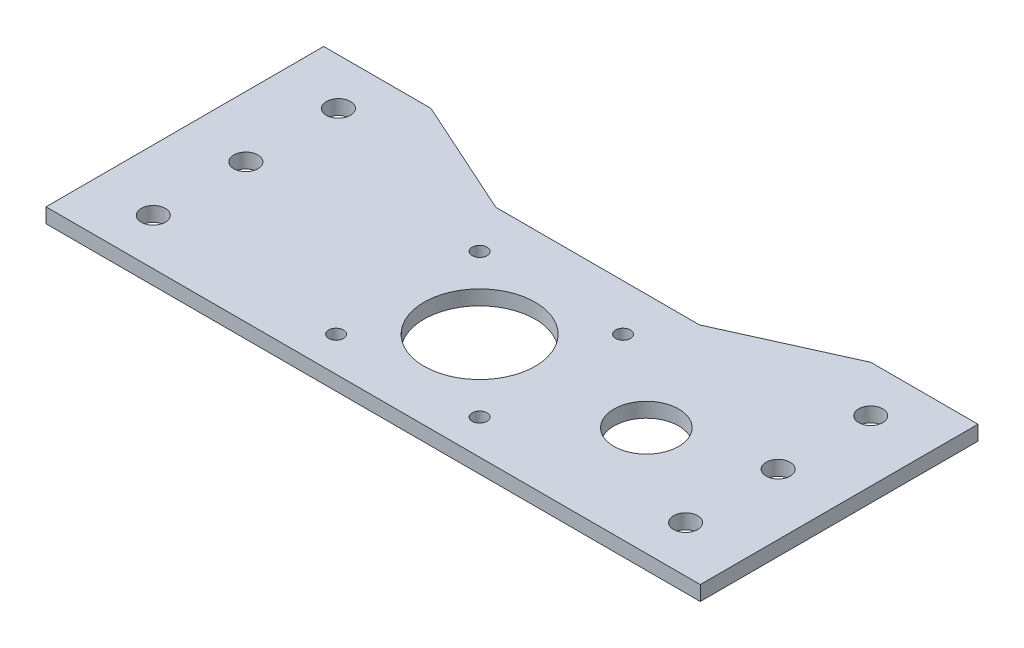
ISO-10303-21;
HEADER;
FILE_DESCRIPTION(('STEP AP214'),'2;1');
FILE_NAME('part.step','',(''),(''),'','','');
FILE_SCHEMA(('AUTOMOTIVE_DESIGN { 1 0 10303 214 1 1 1 1 }'));
ENDSEC;
DATA;
#1=APPLICATION_CONTEXT('core data for automotive mechanical design processes');
#2=APPLICATION_PROTOCOL_DEFINITION('international standard','automotive_design',2000,#1);
#3=PRODUCT_CONTEXT('',#1,'mechanical');
#4=PRODUCT('Part','Part','',(#3));
#5=PRODUCT_RELATED_PRODUCT_CATEGORY('part','',(#4));
#6=PRODUCT_DEFINITION_FORMATION('','',#4);
#7=PRODUCT_DEFINITION_CONTEXT('part definition',#1,'design');
#8=PRODUCT_DEFINITION('design','',#6,#7);
#9=PRODUCT_DEFINITION_SHAPE('','',#8);
#10=(LENGTH_UNIT() NAMED_UNIT(*) SI_UNIT(.MILLI.,.METRE.));
#11=(NAMED_UNIT(*) PLANE_ANGLE_UNIT() SI_UNIT($,.RADIAN.));
#12=(NAMED_UNIT(*) SI_UNIT($,.STERADIAN.) SOLID_ANGLE_UNIT());
#13=UNCERTAINTY_MEASURE_WITH_UNIT(LENGTH_MEASURE(1.E-05),#10,'distance_accuracy_value','');
#14=(GEOMETRIC_REPRESENTATION_CONTEXT(3) GLOBAL_UNCERTAINTY_ASSIGNED_CONTEXT((#13)) GLOBAL_UNIT_ASSIGNED_CONTEXT((#10,
#11,#12)) REPRESENTATION_CONTEXT('',''));
#15=CARTESIAN_POINT('',(0.,0.,0.));
#16=DIRECTION('',(0.,0.,1.));
#17=DIRECTION('',(1.,0.,0.));
#18=AXIS2_PLACEMENT_3D('',#15,#16,#17);
#19=CARTESIAN_POINT('',(0.,3.175,0.));
#20=DIRECTION('',(0.,-1.,0.));
#21=DIRECTION('',(0.,0.,-1.));
#22=AXIS2_PLACEMENT_3D('',#19,#20,#21);
#23=PLANE('',#22);
#24=CARTESIAN_POINT('',(57.5,3.175,-50.));
#25=DIRECTION('',(0.,1.,0.));
#26=DIRECTION('',(0.,0.,-1.));
#27=AXIS2_PLACEMENT_3D('',#24,#25,#26);
#28=CIRCLE('',#27,2.6);
#29=CARTESIAN_POINT('',(57.5,3.175,-52.6));
#30=VERTEX_POINT('',#29);
#31=EDGE_CURVE('E237',#30,#30,#28,.T.);
#32=ORIENTED_EDGE('',*,*,#31,.F.);
#33=EDGE_LOOP('',(#32));
#34=FACE_BOUND('',#33,.T.);
#35=CARTESIAN_POINT('',(15.5,3.175,-7.5));
#36=DIRECTION('',(0.,1.,0.));
#37=DIRECTION('',(0.,0.,1.));
#38=AXIS2_PLACEMENT_3D('',#35,#36,#37);
#39=CIRCLE('',#38,1.6);
#40=CARTESIAN_POINT('',(15.5,3.175,-5.9));
#41=VERTEX_POINT('',#40);
#42=EDGE_CURVE('E225',#41,#41,#39,.T.);
#43=ORIENTED_EDGE('',*,*,#42,.F.);
#44=EDGE_LOOP('',(#43));
#45=FACE_BOUND('',#44,.T.);
#46=CARTESIAN_POINT('',(57.5,3.175,-30.));
#47=DIRECTION('',(0.,1.,0.));
#48=DIRECTION('',(0.,0.,-1.));
#49=AXIS2_PLACEMENT_3D('',#46,#47,#48);
#50=CIRCLE('',#49,2.6);
#51=CARTESIAN_POINT('',(57.5,3.175,-32.6));
#52=VERTEX_POINT('',#51);
#53=EDGE_CURVE('E213',#52,#52,#50,.T.);
#54=ORIENTED_EDGE('',*,*,#53,.F.);
#55=EDGE_LOOP('',(#54));
#56=FACE_BOUND('',#55,.T.);
#57=CARTESIAN_POINT('',(-15.5,3.175,-38.5));
#58=DIRECTION('',(0.,1.,0.));
#59=DIRECTION('',(0.,0.,1.));
#60=AXIS2_PLACEMENT_3D('',#57,#58,#59);
#61=CIRCLE('',#60,1.6);
#62=CARTESIAN_POINT('',(-15.5,3.175,-36.9));
#63=VERTEX_POINT('',#62);
#64=EDGE_CURVE('E201',#63,#63,#61,.T.);
#65=ORIENTED_EDGE('',*,*,#64,.F.);
#66=EDGE_LOOP('',(#65));
#67=FACE_BOUND('',#66,.T.);
#68=CARTESIAN_POINT('',(-57.5,3.175,-9.99999999999999));
#69=DIRECTION('',(0.,1.,0.));
#70=DIRECTION('',(0.,0.,-1.));
#71=AXIS2_PLACEMENT_3D('',#68,#69,#70);
#72=CIRCLE('',#71,2.6);
#73=CARTESIAN_POINT('',(-57.5,3.175,-12.6));
#74=VERTEX_POINT('',#73);
#75=EDGE_CURVE('E189',#74,#74,#72,.T.);
#76=ORIENTED_EDGE('',*,*,#75,.F.);
#77=EDGE_LOOP('',(#76));
#78=FACE_BOUND('',#77,.T.);
#79=CARTESIAN_POINT('',(-57.5,3.175,-30.));
#80=DIRECTION('',(0.,1.,0.));
#81=DIRECTION('',(0.,0.,1.));
#82=AXIS2_PLACEMENT_3D('',#79,#80,#81);
#83=CIRCLE('',#82,2.6);
#84=CARTESIAN_POINT('',(-57.5,3.175,-27.4));
#85=VERTEX_POINT('',#84);
#86=EDGE_CURVE('E135',#85,#85,#83,.T.);
#87=ORIENTED_EDGE('',*,*,#86,.F.);
#88=EDGE_LOOP('',(#87));
#89=FACE_BOUND('',#88,.T.);
#90=DIRECTION('',(0.,0.,1.));
#91=VECTOR('',#90,1.);
#92=CARTESIAN_POINT('',(-70.675,3.175,0.));
#93=LINE('',#92,#91);
#94=CARTESIAN_POINT('',(-70.675,3.175,-60.));
#95=VERTEX_POINT('',#94);
#96=CARTESIAN_POINT('',(-70.675,3.175,0.));
#97=VERTEX_POINT('',#96);
#98=EDGE_CURVE('E146',#95,#97,#93,.T.);
#99=ORIENTED_EDGE('',*,*,#98,.T.);
#100=DIRECTION('',(1.,0.,0.));
#101=VECTOR('',#100,1.);
#102=CARTESIAN_POINT('',(70.675,3.175,0.));
#103=LINE('',#102,#101);
#104=CARTESIAN_POINT('',(70.675,3.175,0.));
#105=VERTEX_POINT('',#104);
#106=EDGE_CURVE('E94',#97,#105,#103,.T.);
#107=ORIENTED_EDGE('',*,*,#106,.T.);
#108=DIRECTION('',(0.,0.,-1.));
#109=VECTOR('',#108,1.);
#110=CARTESIAN_POINT('',(70.675,3.175,0.));
#111=LINE('',#110,#109);
#112=CARTESIAN_POINT('',(70.675,3.175,-60.));
#113=VERTEX_POINT('',#112);
#114=EDGE_CURVE('E161',#105,#113,#111,.T.);
#115=ORIENTED_EDGE('',*,*,#114,.T.);
#116=DIRECTION('',(-1.,0.,0.));
#117=VECTOR('',#116,1.);
#118=CARTESIAN_POINT('',(70.675,3.175,-60.));
#119=LINE('',#118,#117);
#120=CARTESIAN_POINT('',(47.5,3.175,-60.));
#121=VERTEX_POINT('',#120);
#122=EDGE_CURVE('E174',#113,#121,#119,.T.);
#123=ORIENTED_EDGE('',*,*,#122,.T.);
#124=DIRECTION('',(-0.911586756889032,0.,0.411107753106818));
#125=VECTOR('',#124,1.);
#126=CARTESIAN_POINT('',(47.5,3.175,-60.));
#127=LINE('',#126,#125);
#128=CARTESIAN_POINT('',(22.,3.175,-48.5));
#129=VERTEX_POINT('',#128);
#130=EDGE_CURVE('E113',#121,#129,#127,.T.);
#131=ORIENTED_EDGE('',*,*,#130,.T.);
#132=DIRECTION('',(-1.,0.,0.));
#133=VECTOR('',#132,1.);
#134=CARTESIAN_POINT('',(-22.,3.175,-48.5));
#135=LINE('',#134,#133);
#136=CARTESIAN_POINT('',(-22.,3.175,-48.5));
#137=VERTEX_POINT('',#136);
#138=EDGE_CURVE('E107',#129,#137,#135,.T.);
#139=ORIENTED_EDGE('',*,*,#138,.T.);
#140=DIRECTION('',(-0.911586756889032,0.,-0.411107753106818));
#141=VECTOR('',#140,1.);
#142=CARTESIAN_POINT('',(-47.5,3.175,-60.));
#143=LINE('',#142,#141);
#144=CARTESIAN_POINT('',(-47.5,3.175,-60.));
#145=VERTEX_POINT('',#144);
#146=EDGE_CURVE('E111',#137,#145,#143,.T.);
#147=ORIENTED_EDGE('',*,*,#146,.T.);
#148=DIRECTION('',(-1.,0.,0.));
#149=VECTOR('',#148,1.);
#150=CARTESIAN_POINT('',(-70.675,3.175,-60.));
#151=LINE('',#150,#149);
#152=EDGE_CURVE('E51',#145,#95,#151,.T.);
#153=ORIENTED_EDGE('',*,*,#152,.T.);
#154=EDGE_LOOP('',(#99,#107,#115,#123,#131,#139,#147,#153));
#155=FACE_BOUND('',#154,.T.);
#156=CARTESIAN_POINT('',(-57.5,3.175,-50.));
#157=DIRECTION('',(0.,1.,0.));
#158=DIRECTION('',(0.,0.,1.));
#159=AXIS2_PLACEMENT_3D('',#156,#157,#158);
#160=CIRCLE('',#159,2.6);
#161=CARTESIAN_POINT('',(-57.5,3.175,-47.4));
#162=VERTEX_POINT('',#161);
#163=EDGE_CURVE('E183',#162,#162,#160,.T.);
#164=ORIENTED_EDGE('',*,*,#163,.F.);
#165=EDGE_LOOP('',(#164));
#166=FACE_BOUND('',#165,.T.);
#167=CARTESIAN_POINT('',(0.,3.175,-23.));
#168=DIRECTION('',(0.,1.,0.));
#169=DIRECTION('',(0.,0.,1.));
#170=AXIS2_PLACEMENT_3D('',#167,#168,#169);
#171=CIRCLE('',#170,12.);
#172=CARTESIAN_POINT('',(0.,3.175,-11.));
#173=VERTEX_POINT('',#172);
#174=EDGE_CURVE('E195',#173,#173,#171,.T.);
#175=ORIENTED_EDGE('',*,*,#174,.F.);
#176=EDGE_LOOP('',(#175));
#177=FACE_BOUND('',#176,.T.);
#178=CARTESIAN_POINT('',(57.5,3.175,-9.99999999999999));
#179=DIRECTION('',(0.,1.,0.));
#180=DIRECTION('',(0.,0.,1.));
#181=AXIS2_PLACEMENT_3D('',#178,#179,#180);
#182=CIRCLE('',#181,2.6);
#183=CARTESIAN_POINT('',(57.5,3.175,-7.39999999999999));
#184=VERTEX_POINT('',#183);
#185=EDGE_CURVE('E207',#184,#184,#182,.T.);
#186=ORIENTED_EDGE('',*,*,#185,.F.);
#187=EDGE_LOOP('',(#186));
#188=FACE_BOUND('',#187,.T.);
#189=CARTESIAN_POINT('',(15.5,3.175,-38.5));
#190=DIRECTION('',(0.,1.,0.));
#191=DIRECTION('',(0.,0.,1.));
#192=AXIS2_PLACEMENT_3D('',#189,#190,#191);
#193=CIRCLE('',#192,1.6);
#194=CARTESIAN_POINT('',(15.5,3.175,-36.9));
#195=VERTEX_POINT('',#194);
#196=EDGE_CURVE('E219',#195,#195,#193,.T.);
#197=ORIENTED_EDGE('',*,*,#196,.F.);
#198=EDGE_LOOP('',(#197));
#199=FACE_BOUND('',#198,.T.);
#200=CARTESIAN_POINT('',(-15.5,3.175,-7.5));
#201=DIRECTION('',(0.,1.,0.));
#202=DIRECTION('',(0.,0.,1.));
#203=AXIS2_PLACEMENT_3D('',#200,#201,#202);
#204=CIRCLE('',#203,1.6);
#205=CARTESIAN_POINT('',(-15.5,3.175,-5.9));
#206=VERTEX_POINT('',#205);
#207=EDGE_CURVE('E231',#206,#206,#204,.T.);
#208=ORIENTED_EDGE('',*,*,#207,.F.);
#209=EDGE_LOOP('',(#208));
#210=FACE_BOUND('',#209,.T.);
#211=CARTESIAN_POINT('',(35.5,3.175,-23.525));
#212=DIRECTION('',(0.,1.,0.));
#213=DIRECTION('',(0.,0.,1.));
#214=AXIS2_PLACEMENT_3D('',#211,#212,#213);
#215=CIRCLE('',#214,7.);
#216=CARTESIAN_POINT('',(35.5,3.175,-16.525));
#217=VERTEX_POINT('',#216);
#218=EDGE_CURVE('E243',#217,#217,#215,.T.);
#219=ORIENTED_EDGE('',*,*,#218,.F.);
#220=EDGE_LOOP('',(#219));
#221=FACE_BOUND('',#220,.T.);
#222=ADVANCED_FACE('F34',(#34,#45,#56,#67,#78,#89,#155,#166,#177,#188,#199,#210,#221),#23,.F.);
#223=CARTESIAN_POINT('',(0.,0.,0.));
#224=DIRECTION('',(0.,-1.,0.));
#225=DIRECTION('',(0.,0.,-1.));
#226=AXIS2_PLACEMENT_3D('',#223,#224,#225);
#227=PLANE('',#226);
#228=CARTESIAN_POINT('',(57.5,0.,-50.));
#229=DIRECTION('',(0.,1.,0.));
#230=DIRECTION('',(0.,0.,-1.));
#231=AXIS2_PLACEMENT_3D('',#228,#229,#230);
#232=CIRCLE('',#231,2.6);
#233=CARTESIAN_POINT('',(57.5,0.,-52.6));
#234=VERTEX_POINT('',#233);
#235=EDGE_CURVE('E240',#234,#234,#232,.T.);
#236=ORIENTED_EDGE('',*,*,#235,.T.);
#237=EDGE_LOOP('',(#236));
#238=FACE_BOUND('',#237,.T.);
#239=CARTESIAN_POINT('',(15.5,0.,-7.5));
#240=DIRECTION('',(0.,1.,0.));
#241=DIRECTION('',(0.,0.,1.));
#242=AXIS2_PLACEMENT_3D('',#239,#240,#241);
#243=CIRCLE('',#242,1.6);
#244=CARTESIAN_POINT('',(15.5,0.,-5.9));
#245=VERTEX_POINT('',#244);
#246=EDGE_CURVE('E228',#245,#245,#243,.T.);
#247=ORIENTED_EDGE('',*,*,#246,.T.);
#248=EDGE_LOOP('',(#247));
#249=FACE_BOUND('',#248,.T.);
#250=CARTESIAN_POINT('',(57.5,0.,-30.));
#251=DIRECTION('',(0.,1.,0.));
#252=DIRECTION('',(0.,0.,-1.));
#253=AXIS2_PLACEMENT_3D('',#250,#251,#252);
#254=CIRCLE('',#253,2.6);
#255=CARTESIAN_POINT('',(57.5,0.,-32.6));
#256=VERTEX_POINT('',#255);
#257=EDGE_CURVE('E216',#256,#256,#254,.T.);
#258=ORIENTED_EDGE('',*,*,#257,.T.);
#259=EDGE_LOOP('',(#258));
#260=FACE_BOUND('',#259,.T.);
#261=CARTESIAN_POINT('',(-15.5,0.,-38.5));
#262=DIRECTION('',(0.,1.,0.));
#263=DIRECTION('',(0.,0.,1.));
#264=AXIS2_PLACEMENT_3D('',#261,#262,#263);
#265=CIRCLE('',#264,1.6);
#266=CARTESIAN_POINT('',(-15.5,0.,-36.9));
#267=VERTEX_POINT('',#266);
#268=EDGE_CURVE('E204',#267,#267,#265,.T.);
#269=ORIENTED_EDGE('',*,*,#268,.T.);
#270=EDGE_LOOP('',(#269));
#271=FACE_BOUND('',#270,.T.);
#272=CARTESIAN_POINT('',(-57.5,0.,-9.99999999999999));
#273=DIRECTION('',(0.,1.,0.));
#274=DIRECTION('',(0.,0.,-1.));
#275=AXIS2_PLACEMENT_3D('',#272,#273,#274);
#276=CIRCLE('',#275,2.6);
#277=CARTESIAN_POINT('',(-57.5,0.,-12.6));
#278=VERTEX_POINT('',#277);
#279=EDGE_CURVE('E192',#278,#278,#276,.T.);
#280=ORIENTED_EDGE('',*,*,#279,.T.);
#281=EDGE_LOOP('',(#280));
#282=FACE_BOUND('',#281,.T.);
#283=CARTESIAN_POINT('',(-57.5,0.,-30.));
#284=DIRECTION('',(0.,1.,0.));
#285=DIRECTION('',(0.,0.,1.));
#286=AXIS2_PLACEMENT_3D('',#283,#284,#285);
#287=CIRCLE('',#286,2.6);
#288=CARTESIAN_POINT('',(-57.5,0.,-27.4));
#289=VERTEX_POINT('',#288);
#290=EDGE_CURVE('E180',#289,#289,#287,.T.);
#291=ORIENTED_EDGE('',*,*,#290,.T.);
#292=EDGE_LOOP('',(#291));
#293=FACE_BOUND('',#292,.T.);
#294=DIRECTION('',(0.,0.,1.));
#295=VECTOR('',#294,1.);
#296=CARTESIAN_POINT('',(-70.675,0.,0.));
#297=LINE('',#296,#295);
#298=CARTESIAN_POINT('',(-70.675,0.,-60.));
#299=VERTEX_POINT('',#298);
#300=CARTESIAN_POINT('',(-70.675,0.,0.));
#301=VERTEX_POINT('',#300);
#302=EDGE_CURVE('E131',#299,#301,#297,.T.);
#303=ORIENTED_EDGE('',*,*,#302,.F.);
#304=DIRECTION('',(-1.,0.,0.));
#305=VECTOR('',#304,1.);
#306=CARTESIAN_POINT('',(-70.675,0.,-60.));
#307=LINE('',#306,#305);
#308=CARTESIAN_POINT('',(-47.5,0.,-60.));
#309=VERTEX_POINT('',#308);
#310=EDGE_CURVE('E86',#309,#299,#307,.T.);
#311=ORIENTED_EDGE('',*,*,#310,.F.);
#312=DIRECTION('',(-0.911586756889032,0.,-0.411107753106818));
#313=VECTOR('',#312,1.);
#314=CARTESIAN_POINT('',(-47.5,0.,-60.));
#315=LINE('',#314,#313);
#316=CARTESIAN_POINT('',(-22.,0.,-48.5));
#317=VERTEX_POINT('',#316);
#318=EDGE_CURVE('E80',#317,#309,#315,.T.);
#319=ORIENTED_EDGE('',*,*,#318,.F.);
#320=DIRECTION('',(-1.,0.,0.));
#321=VECTOR('',#320,1.);
#322=CARTESIAN_POINT('',(-22.,0.,-48.5));
#323=LINE('',#322,#321);
#324=CARTESIAN_POINT('',(22.,0.,-48.5));
#325=VERTEX_POINT('',#324);
#326=EDGE_CURVE('E121',#325,#317,#323,.T.);
#327=ORIENTED_EDGE('',*,*,#326,.F.);
#328=DIRECTION('',(-0.911586756889032,0.,0.411107753106818));
#329=VECTOR('',#328,1.);
#330=CARTESIAN_POINT('',(47.5,0.,-60.));
#331=LINE('',#330,#329);
#332=CARTESIAN_POINT('',(47.5,0.,-60.));
#333=VERTEX_POINT('',#332);
#334=EDGE_CURVE('E141',#333,#325,#331,.T.);
#335=ORIENTED_EDGE('',*,*,#334,.F.);
#336=DIRECTION('',(-1.,0.,0.));
#337=VECTOR('',#336,1.);
#338=CARTESIAN_POINT('',(70.675,0.,-60.));
#339=LINE('',#338,#337);
#340=CARTESIAN_POINT('',(70.675,0.,-60.));
#341=VERTEX_POINT('',#340);
#342=EDGE_CURVE('E139',#341,#333,#339,.T.);
#343=ORIENTED_EDGE('',*,*,#342,.F.);
#344=DIRECTION('',(0.,0.,-1.));
#345=VECTOR('',#344,1.);
#346=CARTESIAN_POINT('',(70.675,0.,0.));
#347=LINE('',#346,#345);
#348=CARTESIAN_POINT('',(70.675,0.,0.));
#349=VERTEX_POINT('',#348);
#350=EDGE_CURVE('E137',#349,#341,#347,.T.);
#351=ORIENTED_EDGE('',*,*,#350,.F.);
#352=DIRECTION('',(1.,0.,0.));
#353=VECTOR('',#352,1.);
#354=CARTESIAN_POINT('',(70.675,0.,0.));
#355=LINE('',#354,#353);
#356=EDGE_CURVE('E134',#301,#349,#355,.T.);
#357=ORIENTED_EDGE('',*,*,#356,.F.);
#358=EDGE_LOOP('',(#303,#311,#319,#327,#335,#343,#351,#357));
#359=FACE_BOUND('',#358,.T.);
#360=CARTESIAN_POINT('',(-57.5,0.,-50.));
#361=DIRECTION('',(0.,1.,0.));
#362=DIRECTION('',(0.,0.,1.));
#363=AXIS2_PLACEMENT_3D('',#360,#361,#362);
#364=CIRCLE('',#363,2.6);
#365=CARTESIAN_POINT('',(-57.5,0.,-47.4));
#366=VERTEX_POINT('',#365);
#367=EDGE_CURVE('E186',#366,#366,#364,.T.);
#368=ORIENTED_EDGE('',*,*,#367,.T.);
#369=EDGE_LOOP('',(#368));
#370=FACE_BOUND('',#369,.T.);
#371=CARTESIAN_POINT('',(0.,0.,-23.));
#372=DIRECTION('',(0.,1.,0.));
#373=DIRECTION('',(0.,0.,1.));
#374=AXIS2_PLACEMENT_3D('',#371,#372,#373);
#375=CIRCLE('',#374,12.);
#376=CARTESIAN_POINT('',(0.,0.,-11.));
#377=VERTEX_POINT('',#376);
#378=EDGE_CURVE('E198',#377,#377,#375,.T.);
#379=ORIENTED_EDGE('',*,*,#378,.T.);
#380=EDGE_LOOP('',(#379));
#381=FACE_BOUND('',#380,.T.);
#382=CARTESIAN_POINT('',(57.5,0.,-9.99999999999999));
#383=DIRECTION('',(0.,1.,0.));
#384=DIRECTION('',(0.,0.,1.));
#385=AXIS2_PLACEMENT_3D('',#382,#383,#384);
#386=CIRCLE('',#385,2.6);
#387=CARTESIAN_POINT('',(57.5,0.,-7.39999999999999));
#388=VERTEX_POINT('',#387);
#389=EDGE_CURVE('E210',#388,#388,#386,.T.);
#390=ORIENTED_EDGE('',*,*,#389,.T.);
#391=EDGE_LOOP('',(#390));
#392=FACE_BOUND('',#391,.T.);
#393=CARTESIAN_POINT('',(15.5,0.,-38.5));
#394=DIRECTION('',(0.,1.,0.));
#395=DIRECTION('',(0.,0.,1.));
#396=AXIS2_PLACEMENT_3D('',#393,#394,#395);
#397=CIRCLE('',#396,1.6);
#398=CARTESIAN_POINT('',(15.5,0.,-36.9));
#399=VERTEX_POINT('',#398);
#400=EDGE_CURVE('E222',#399,#399,#397,.T.);
#401=ORIENTED_EDGE('',*,*,#400,.T.);
#402=EDGE_LOOP('',(#401));
#403=FACE_BOUND('',#402,.T.);
#404=CARTESIAN_POINT('',(-15.5,0.,-7.5));
#405=DIRECTION('',(0.,1.,0.));
#406=DIRECTION('',(0.,0.,1.));
#407=AXIS2_PLACEMENT_3D('',#404,#405,#406);
#408=CIRCLE('',#407,1.6);
#409=CARTESIAN_POINT('',(-15.5,0.,-5.9));
#410=VERTEX_POINT('',#409);
#411=EDGE_CURVE('E234',#410,#410,#408,.T.);
#412=ORIENTED_EDGE('',*,*,#411,.T.);
#413=EDGE_LOOP('',(#412));
#414=FACE_BOUND('',#413,.T.);
#415=CARTESIAN_POINT('',(35.5,0.,-23.525));
#416=DIRECTION('',(0.,1.,0.));
#417=DIRECTION('',(0.,0.,1.));
#418=AXIS2_PLACEMENT_3D('',#415,#416,#417);
#419=CIRCLE('',#418,7.);
#420=CARTESIAN_POINT('',(35.5,0.,-16.525));
#421=VERTEX_POINT('',#420);
#422=EDGE_CURVE('E246',#421,#421,#419,.T.);
#423=ORIENTED_EDGE('',*,*,#422,.T.);
#424=EDGE_LOOP('',(#423));
#425=FACE_BOUND('',#424,.T.);
#426=ADVANCED_FACE('F165',(#238,#249,#260,#271,#282,#293,#359,#370,#381,#392,#403,#414,#425),
#227,.T.);
#427=CARTESIAN_POINT('',(-70.675,3.175,0.));
#428=DIRECTION('',(1.,0.,0.));
#429=DIRECTION('',(0.,0.,-1.));
#430=AXIS2_PLACEMENT_3D('',#427,#428,#429);
#431=PLANE('',#430);
#432=ORIENTED_EDGE('',*,*,#302,.T.);
#433=DIRECTION('',(0.,-1.,0.));
#434=VECTOR('',#433,1.);
#435=CARTESIAN_POINT('',(-70.675,3.175,0.));
#436=LINE('',#435,#434);
#437=EDGE_CURVE('E11',#97,#301,#436,.T.);
#438=ORIENTED_EDGE('',*,*,#437,.F.);
#439=ORIENTED_EDGE('',*,*,#98,.F.);
#440=DIRECTION('',(0.,-1.,0.));
#441=VECTOR('',#440,1.);
#442=CARTESIAN_POINT('',(-70.675,3.175,-60.));
#443=LINE('',#442,#441);
#444=EDGE_CURVE('E127',#95,#299,#443,.T.);
#445=ORIENTED_EDGE('',*,*,#444,.T.);
#446=EDGE_LOOP('',(#432,#438,#439,#445));
#447=FACE_BOUND('',#446,.T.);
#448=ADVANCED_FACE('F36',(#447),#431,.F.);
#449=CARTESIAN_POINT('',(70.675,3.175,0.));
#450=DIRECTION('',(0.,0.,-1.));
#451=DIRECTION('',(-1.,0.,0.));
#452=AXIS2_PLACEMENT_3D('',#449,#450,#451);
#453=PLANE('',#452);
#454=ORIENTED_EDGE('',*,*,#356,.T.);
#455=DIRECTION('',(0.,-1.,0.));
#456=VECTOR('',#455,1.);
#457=CARTESIAN_POINT('',(70.675,3.175,0.));
#458=LINE('',#457,#456);
#459=EDGE_CURVE('E43',#105,#349,#458,.T.);
#460=ORIENTED_EDGE('',*,*,#459,.F.);
#461=ORIENTED_EDGE('',*,*,#106,.F.);
#462=ORIENTED_EDGE('',*,*,#437,.T.);
#463=EDGE_LOOP('',(#454,#460,#461,#462));
#464=FACE_BOUND('',#463,.T.);
#465=ADVANCED_FACE('F281',(#464),#453,.F.);
#466=CARTESIAN_POINT('',(70.675,3.175,0.));
#467=DIRECTION('',(-1.,0.,0.));
#468=DIRECTION('',(0.,0.,1.));
#469=AXIS2_PLACEMENT_3D('',#466,#467,#468);
#470=PLANE('',#469);
#471=ORIENTED_EDGE('',*,*,#350,.T.);
#472=DIRECTION('',(0.,-1.,0.));
#473=VECTOR('',#472,1.);
#474=CARTESIAN_POINT('',(70.675,3.175,-60.));
#475=LINE('',#474,#473);
#476=EDGE_CURVE('E153',#113,#341,#475,.T.);
#477=ORIENTED_EDGE('',*,*,#476,.F.);
#478=ORIENTED_EDGE('',*,*,#114,.F.);
#479=ORIENTED_EDGE('',*,*,#459,.T.);
#480=EDGE_LOOP('',(#471,#477,#478,#479));
#481=FACE_BOUND('',#480,.T.);
#482=ADVANCED_FACE('F159',(#481),#470,.F.);
#483=CARTESIAN_POINT('',(70.675,3.175,-60.));
#484=DIRECTION('',(0.,0.,1.));
#485=DIRECTION('',(1.,0.,0.));
#486=AXIS2_PLACEMENT_3D('',#483,#484,#485);
#487=PLANE('',#486);
#488=ORIENTED_EDGE('',*,*,#342,.T.);
#489=DIRECTION('',(0.,-1.,0.));
#490=VECTOR('',#489,1.);
#491=CARTESIAN_POINT('',(47.5,3.175,-60.));
#492=LINE('',#491,#490);
#493=EDGE_CURVE('E150',#121,#333,#492,.T.);
#494=ORIENTED_EDGE('',*,*,#493,.F.);
#495=ORIENTED_EDGE('',*,*,#122,.F.);
#496=ORIENTED_EDGE('',*,*,#476,.T.);
#497=EDGE_LOOP('',(#488,#494,#495,#496));
#498=FACE_BOUND('',#497,.T.);
#499=ADVANCED_FACE('F170',(#498),#487,.F.);
#500=CARTESIAN_POINT('',(47.5,3.175,-60.));
#501=DIRECTION('',(0.411107753106818,0.,0.911586756889032));
#502=DIRECTION('',(0.911586756889032,0.,-0.411107753106818));
#503=AXIS2_PLACEMENT_3D('',#500,#501,#502);
#504=PLANE('',#503);
#505=ORIENTED_EDGE('',*,*,#334,.T.);
#506=DIRECTION('',(0.,-1.,0.));
#507=VECTOR('',#506,1.);
#508=CARTESIAN_POINT('',(22.,3.175,-48.5));
#509=LINE('',#508,#507);
#510=EDGE_CURVE('E122',#129,#325,#509,.T.);
#511=ORIENTED_EDGE('',*,*,#510,.F.);
#512=ORIENTED_EDGE('',*,*,#130,.F.);
#513=ORIENTED_EDGE('',*,*,#493,.T.);
#514=EDGE_LOOP('',(#505,#511,#512,#513));
#515=FACE_BOUND('',#514,.T.);
#516=ADVANCED_FACE('F173',(#515),#504,.F.);
#517=CARTESIAN_POINT('',(-22.,3.175,-48.5));
#518=DIRECTION('',(0.,0.,1.));
#519=DIRECTION('',(1.,0.,0.));
#520=AXIS2_PLACEMENT_3D('',#517,#518,#519);
#521=PLANE('',#520);
#522=ORIENTED_EDGE('',*,*,#326,.T.);
#523=DIRECTION('',(0.,-1.,0.));
#524=VECTOR('',#523,1.);
#525=CARTESIAN_POINT('',(-22.,3.175,-48.5));
#526=LINE('',#525,#524);
#527=EDGE_CURVE('E118',#137,#317,#526,.T.);
#528=ORIENTED_EDGE('',*,*,#527,.F.);
#529=ORIENTED_EDGE('',*,*,#138,.F.);
#530=ORIENTED_EDGE('',*,*,#510,.T.);
#531=EDGE_LOOP('',(#522,#528,#529,#530));
#532=FACE_BOUND('',#531,.T.);
#533=ADVANCED_FACE('F119',(#532),#521,.F.);
#534=CARTESIAN_POINT('',(-47.5,3.175,-60.));
#535=DIRECTION('',(-0.411107753106818,0.,0.911586756889032));
#536=DIRECTION('',(0.911586756889032,0.,0.411107753106818));
#537=AXIS2_PLACEMENT_3D('',#534,#535,#536);
#538=PLANE('',#537);
#539=ORIENTED_EDGE('',*,*,#318,.T.);
#540=DIRECTION('',(0.,-1.,0.));
#541=VECTOR('',#540,1.);
#542=CARTESIAN_POINT('',(-47.5,3.175,-60.));
#543=LINE('',#542,#541);
#544=EDGE_CURVE('E123',#145,#309,#543,.T.);
#545=ORIENTED_EDGE('',*,*,#544,.F.);
#546=ORIENTED_EDGE('',*,*,#146,.F.);
#547=ORIENTED_EDGE('',*,*,#527,.T.);
#548=EDGE_LOOP('',(#539,#545,#546,#547));
#549=FACE_BOUND('',#548,.T.);
#550=ADVANCED_FACE('F125',(#549),#538,.F.);
#551=CARTESIAN_POINT('',(-70.675,3.175,-60.));
#552=DIRECTION('',(0.,0.,1.));
#553=DIRECTION('',(1.,0.,0.));
#554=AXIS2_PLACEMENT_3D('',#551,#552,#553);
#555=PLANE('',#554);
#556=ORIENTED_EDGE('',*,*,#310,.T.);
#557=ORIENTED_EDGE('',*,*,#444,.F.);
#558=ORIENTED_EDGE('',*,*,#152,.F.);
#559=ORIENTED_EDGE('',*,*,#544,.T.);
#560=EDGE_LOOP('',(#556,#557,#558,#559));
#561=FACE_BOUND('',#560,.T.);
#562=ADVANCED_FACE('F269',(#561),#555,.F.);
#563=CARTESIAN_POINT('',(-57.5,3.175,-30.));
#564=DIRECTION('',(0.,-1.,0.));
#565=DIRECTION('',(0.,0.,-1.));
#566=AXIS2_PLACEMENT_3D('',#563,#564,#565);
#567=CYLINDRICAL_SURFACE('',#566,2.6);
#568=ORIENTED_EDGE('',*,*,#86,.T.);
#569=EDGE_LOOP('',(#568));
#570=FACE_BOUND('',#569,.T.);
#571=ORIENTED_EDGE('',*,*,#290,.F.);
#572=EDGE_LOOP('',(#571));
#573=FACE_BOUND('',#572,.T.);
#574=ADVANCED_FACE('F266',(#570,#573),#567,.F.);
#575=CARTESIAN_POINT('',(-57.5,3.175,-50.));
#576=DIRECTION('',(0.,-1.,0.));
#577=DIRECTION('',(0.,0.,-1.));
#578=AXIS2_PLACEMENT_3D('',#575,#576,#577);
#579=CYLINDRICAL_SURFACE('',#578,2.6);
#580=ORIENTED_EDGE('',*,*,#163,.T.);
#581=EDGE_LOOP('',(#580));
#582=FACE_BOUND('',#581,.T.);
#583=ORIENTED_EDGE('',*,*,#367,.F.);
#584=EDGE_LOOP('',(#583));
#585=FACE_BOUND('',#584,.T.);
#586=ADVANCED_FACE('F353',(#582,#585),#579,.F.);
#587=CARTESIAN_POINT('',(-57.5,3.175,-9.99999999999999));
#588=DIRECTION('',(0.,-1.,0.));
#589=DIRECTION('',(0.,0.,-1.));
#590=AXIS2_PLACEMENT_3D('',#587,#588,#589);
#591=CYLINDRICAL_SURFACE('',#590,2.6);
#592=ORIENTED_EDGE('',*,*,#75,.T.);
#593=EDGE_LOOP('',(#592));
#594=FACE_BOUND('',#593,.T.);
#595=ORIENTED_EDGE('',*,*,#279,.F.);
#596=EDGE_LOOP('',(#595));
#597=FACE_BOUND('',#596,.T.);
#598=ADVANCED_FACE('F361',(#594,#597),#591,.F.);
#599=CARTESIAN_POINT('',(0.,3.175,-23.));
#600=DIRECTION('',(0.,-1.,0.));
#601=DIRECTION('',(0.,0.,-1.));
#602=AXIS2_PLACEMENT_3D('',#599,#600,#601);
#603=CYLINDRICAL_SURFACE('',#602,12.);
#604=ORIENTED_EDGE('',*,*,#174,.T.);
#605=EDGE_LOOP('',(#604));
#606=FACE_BOUND('',#605,.T.);
#607=ORIENTED_EDGE('',*,*,#378,.F.);
#608=EDGE_LOOP('',(#607));
#609=FACE_BOUND('',#608,.T.);
#610=ADVANCED_FACE('F369',(#606,#609),#603,.F.);
#611=CARTESIAN_POINT('',(-15.5,3.175,-38.5));
#612=DIRECTION('',(0.,-1.,0.));
#613=DIRECTION('',(0.,0.,-1.));
#614=AXIS2_PLACEMENT_3D('',#611,#612,#613);
#615=CYLINDRICAL_SURFACE('',#614,1.6);
#616=ORIENTED_EDGE('',*,*,#64,.T.);
#617=EDGE_LOOP('',(#616));
#618=FACE_BOUND('',#617,.T.);
#619=ORIENTED_EDGE('',*,*,#268,.F.);
#620=EDGE_LOOP('',(#619));
#621=FACE_BOUND('',#620,.T.);
#622=ADVANCED_FACE('F378',(#618,#621),#615,.F.);
#623=CARTESIAN_POINT('',(57.5,3.175,-9.99999999999999));
#624=DIRECTION('',(0.,-1.,0.));
#625=DIRECTION('',(0.,0.,-1.));
#626=AXIS2_PLACEMENT_3D('',#623,#624,#625);
#627=CYLINDRICAL_SURFACE('',#626,2.6);
#628=ORIENTED_EDGE('',*,*,#185,.T.);
#629=EDGE_LOOP('',(#628));
#630=FACE_BOUND('',#629,.T.);
#631=ORIENTED_EDGE('',*,*,#389,.F.);
#632=EDGE_LOOP('',(#631));
#633=FACE_BOUND('',#632,.T.);
#634=ADVANCED_FACE('F387',(#630,#633),#627,.F.);
#635=CARTESIAN_POINT('',(57.5,3.175,-30.));
#636=DIRECTION('',(0.,-1.,0.));
#637=DIRECTION('',(0.,0.,-1.));
#638=AXIS2_PLACEMENT_3D('',#635,#636,#637);
#639=CYLINDRICAL_SURFACE('',#638,2.6);
#640=ORIENTED_EDGE('',*,*,#53,.T.);
#641=EDGE_LOOP('',(#640));
#642=FACE_BOUND('',#641,.T.);
#643=ORIENTED_EDGE('',*,*,#257,.F.);
#644=EDGE_LOOP('',(#643));
#645=FACE_BOUND('',#644,.T.);
#646=ADVANCED_FACE('F396',(#642,#645),#639,.F.);
#647=CARTESIAN_POINT('',(15.5,3.175,-38.5));
#648=DIRECTION('',(0.,-1.,0.));
#649=DIRECTION('',(0.,0.,-1.));
#650=AXIS2_PLACEMENT_3D('',#647,#648,#649);
#651=CYLINDRICAL_SURFACE('',#650,1.6);
#652=ORIENTED_EDGE('',*,*,#196,.T.);
#653=EDGE_LOOP('',(#652));
#654=FACE_BOUND('',#653,.T.);
#655=ORIENTED_EDGE('',*,*,#400,.F.);
#656=EDGE_LOOP('',(#655));
#657=FACE_BOUND('',#656,.T.);
#658=ADVANCED_FACE('F405',(#654,#657),#651,.F.);
#659=CARTESIAN_POINT('',(15.5,3.175,-7.5));
#660=DIRECTION('',(0.,-1.,0.));
#661=DIRECTION('',(0.,0.,-1.));
#662=AXIS2_PLACEMENT_3D('',#659,#660,#661);
#663=CYLINDRICAL_SURFACE('',#662,1.6);
#664=ORIENTED_EDGE('',*,*,#42,.T.);
#665=EDGE_LOOP('',(#664));
#666=FACE_BOUND('',#665,.T.);
#667=ORIENTED_EDGE('',*,*,#246,.F.);
#668=EDGE_LOOP('',(#667));
#669=FACE_BOUND('',#668,.T.);
#670=ADVANCED_FACE('F414',(#666,#669),#663,.F.);
#671=CARTESIAN_POINT('',(-15.5,3.175,-7.5));
#672=DIRECTION('',(0.,-1.,0.));
#673=DIRECTION('',(0.,0.,-1.));
#674=AXIS2_PLACEMENT_3D('',#671,#672,#673);
#675=CYLINDRICAL_SURFACE('',#674,1.6);
#676=ORIENTED_EDGE('',*,*,#207,.T.);
#677=EDGE_LOOP('',(#676));
#678=FACE_BOUND('',#677,.T.);
#679=ORIENTED_EDGE('',*,*,#411,.F.);
#680=EDGE_LOOP('',(#679));
#681=FACE_BOUND('',#680,.T.);
#682=ADVANCED_FACE('F423',(#678,#681),#675,.F.);
#683=CARTESIAN_POINT('',(57.5,3.175,-50.));
#684=DIRECTION('',(0.,-1.,0.));
#685=DIRECTION('',(0.,0.,-1.));
#686=AXIS2_PLACEMENT_3D('',#683,#684,#685);
#687=CYLINDRICAL_SURFACE('',#686,2.6);
#688=ORIENTED_EDGE('',*,*,#31,.T.);
#689=EDGE_LOOP('',(#688));
#690=FACE_BOUND('',#689,.T.);
#691=ORIENTED_EDGE('',*,*,#235,.F.);
#692=EDGE_LOOP('',(#691));
#693=FACE_BOUND('',#692,.T.);
#694=ADVANCED_FACE('F432',(#690,#693),#687,.F.);
#695=CARTESIAN_POINT('',(35.5,3.175,-23.525));
#696=DIRECTION('',(0.,-1.,0.));
#697=DIRECTION('',(0.,0.,-1.));
#698=AXIS2_PLACEMENT_3D('',#695,#696,#697);
#699=CYLINDRICAL_SURFACE('',#698,7.);
#700=ORIENTED_EDGE('',*,*,#218,.T.);
#701=EDGE_LOOP('',(#700));
#702=FACE_BOUND('',#701,.T.);
#703=ORIENTED_EDGE('',*,*,#422,.F.);
#704=EDGE_LOOP('',(#703));
#705=FACE_BOUND('',#704,.T.);
#706=ADVANCED_FACE('F252',(#702,#705),#699,.F.);
#707=CLOSED_SHELL('',(#222,#426,#448,#465,#482,#499,#516,#533,#550,#562,#574,#586,#598,#610,
#622,#634,#646,#658,#670,#682,#694,#706));
#708=MANIFOLD_SOLID_BREP('B2',#707);
#709=ADVANCED_BREP_SHAPE_REPRESENTATION('',(#18,#708),#14);
#710=SHAPE_DEFINITION_REPRESENTATION(#9,#709);
ENDSEC;
END-ISO-10303-21;
